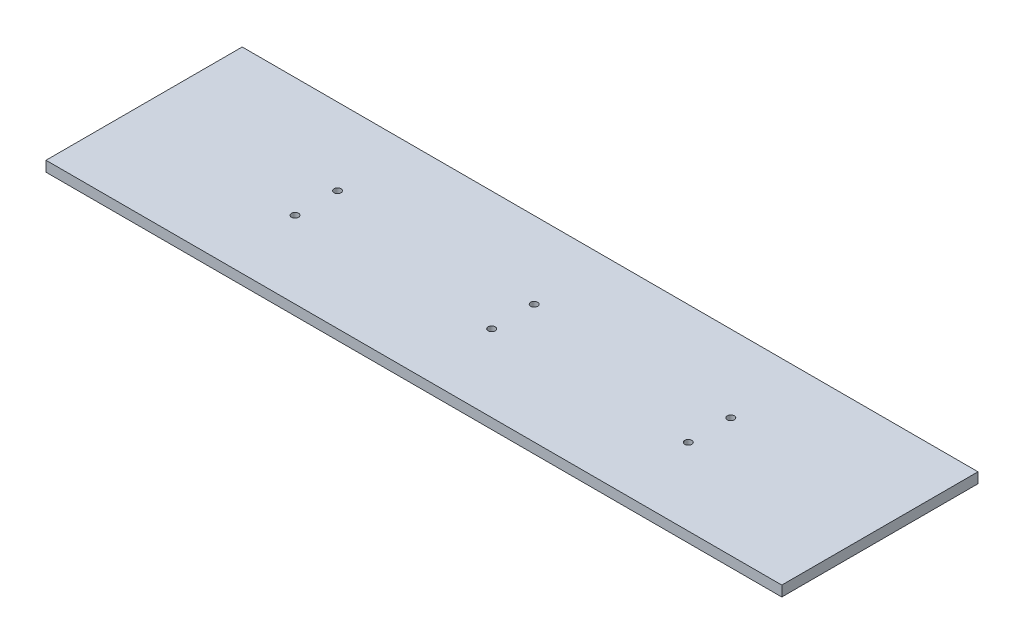
ISO-10303-21;
HEADER;
FILE_DESCRIPTION(('STEP AP214'),'2;1');
FILE_NAME('part.step','',(''),(''),'','','');
FILE_SCHEMA(('AUTOMOTIVE_DESIGN { 1 0 10303 214 1 1 1 1 }'));
ENDSEC;
DATA;
#1=APPLICATION_CONTEXT('core data for automotive mechanical design processes');
#2=APPLICATION_PROTOCOL_DEFINITION('international standard','automotive_design',2000,#1);
#3=PRODUCT_CONTEXT('',#1,'mechanical');
#4=PRODUCT('Part','Part','',(#3));
#5=PRODUCT_RELATED_PRODUCT_CATEGORY('part','',(#4));
#6=PRODUCT_DEFINITION_FORMATION('','',#4);
#7=PRODUCT_DEFINITION_CONTEXT('part definition',#1,'design');
#8=PRODUCT_DEFINITION('design','',#6,#7);
#9=PRODUCT_DEFINITION_SHAPE('','',#8);
#10=(LENGTH_UNIT() NAMED_UNIT(*) SI_UNIT(.MILLI.,.METRE.));
#11=(NAMED_UNIT(*) PLANE_ANGLE_UNIT() SI_UNIT($,.RADIAN.));
#12=(NAMED_UNIT(*) SI_UNIT($,.STERADIAN.) SOLID_ANGLE_UNIT());
#13=UNCERTAINTY_MEASURE_WITH_UNIT(LENGTH_MEASURE(1.E-05),#10,'distance_accuracy_value','');
#14=(GEOMETRIC_REPRESENTATION_CONTEXT(3) GLOBAL_UNCERTAINTY_ASSIGNED_CONTEXT((#13)) GLOBAL_UNIT_ASSIGNED_CONTEXT((#10,
#11,#12)) REPRESENTATION_CONTEXT('',''));
#15=CARTESIAN_POINT('',(0.,0.,0.));
#16=DIRECTION('',(0.,0.,1.));
#17=DIRECTION('',(1.,0.,0.));
#18=AXIS2_PLACEMENT_3D('',#15,#16,#17);
#19=CARTESIAN_POINT('',(0.,6.35,0.));
#20=DIRECTION('',(0.,-1.,0.));
#21=DIRECTION('',(0.,0.,-1.));
#22=AXIS2_PLACEMENT_3D('',#19,#20,#21);
#23=PLANE('',#22);
#24=DIRECTION('',(0.,0.,1.));
#25=VECTOR('',#24,1.);
#26=CARTESIAN_POINT('',(0.,6.35,0.));
#27=LINE('',#26,#25);
#28=CARTESIAN_POINT('',(0.,6.35,-120.));
#29=VERTEX_POINT('',#28);
#30=CARTESIAN_POINT('',(0.,6.35,0.));
#31=VERTEX_POINT('',#30);
#32=EDGE_CURVE('E102',#29,#31,#27,.T.);
#33=ORIENTED_EDGE('',*,*,#32,.T.);
#34=DIRECTION('',(1.,0.,0.));
#35=VECTOR('',#34,1.);
#36=CARTESIAN_POINT('',(0.,6.35,0.));
#37=LINE('',#36,#35);
#38=CARTESIAN_POINT('',(450.,6.35,0.));
#39=VERTEX_POINT('',#38);
#40=EDGE_CURVE('E97',#31,#39,#37,.T.);
#41=ORIENTED_EDGE('',*,*,#40,.T.);
#42=DIRECTION('',(0.,0.,-1.));
#43=VECTOR('',#42,1.);
#44=CARTESIAN_POINT('',(450.,6.35,0.));
#45=LINE('',#44,#43);
#46=CARTESIAN_POINT('',(450.,6.35,-120.));
#47=VERTEX_POINT('',#46);
#48=EDGE_CURVE('E100',#39,#47,#45,.T.);
#49=ORIENTED_EDGE('',*,*,#48,.T.);
#50=DIRECTION('',(-1.,0.,0.));
#51=VECTOR('',#50,1.);
#52=CARTESIAN_POINT('',(0.,6.35,-120.));
#53=LINE('',#52,#51);
#54=EDGE_CURVE('E67',#47,#29,#53,.T.);
#55=ORIENTED_EDGE('',*,*,#54,.T.);
#56=EDGE_LOOP('',(#33,#41,#49,#55));
#57=FACE_BOUND('',#56,.T.);
#58=CARTESIAN_POINT('',(345.81,6.35,-47.));
#59=DIRECTION('',(0.,1.,0.));
#60=DIRECTION('',(0.,0.,1.));
#61=AXIS2_PLACEMENT_3D('',#58,#59,#60);
#62=CIRCLE('',#61,2.16);
#63=CARTESIAN_POINT('',(345.81,6.35,-44.84));
#64=VERTEX_POINT('',#63);
#65=EDGE_CURVE('E122',#64,#64,#62,.T.);
#66=ORIENTED_EDGE('',*,*,#65,.F.);
#67=EDGE_LOOP('',(#66));
#68=FACE_BOUND('',#67,.T.);
#69=CARTESIAN_POINT('',(225.56,6.35,-47.));
#70=DIRECTION('',(0.,1.,0.));
#71=DIRECTION('',(0.,0.,1.));
#72=AXIS2_PLACEMENT_3D('',#69,#70,#71);
#73=CIRCLE('',#72,2.16);
#74=CARTESIAN_POINT('',(225.56,6.35,-44.84));
#75=VERTEX_POINT('',#74);
#76=EDGE_CURVE('E144',#75,#75,#73,.T.);
#77=ORIENTED_EDGE('',*,*,#76,.F.);
#78=EDGE_LOOP('',(#77));
#79=FACE_BOUND('',#78,.T.);
#80=CARTESIAN_POINT('',(105.31,6.35,-47.));
#81=DIRECTION('',(0.,1.,0.));
#82=DIRECTION('',(0.,0.,1.));
#83=AXIS2_PLACEMENT_3D('',#80,#81,#82);
#84=CIRCLE('',#83,2.16);
#85=CARTESIAN_POINT('',(105.31,6.35,-44.84));
#86=VERTEX_POINT('',#85);
#87=EDGE_CURVE('E152',#86,#86,#84,.T.);
#88=ORIENTED_EDGE('',*,*,#87,.F.);
#89=EDGE_LOOP('',(#88));
#90=FACE_BOUND('',#89,.T.);
#91=CARTESIAN_POINT('',(105.31,6.35,-73.));
#92=DIRECTION('',(0.,1.,0.));
#93=DIRECTION('',(0.,0.,-1.));
#94=AXIS2_PLACEMENT_3D('',#91,#92,#93);
#95=CIRCLE('',#94,2.16);
#96=CARTESIAN_POINT('',(105.31,6.35,-75.16));
#97=VERTEX_POINT('',#96);
#98=EDGE_CURVE('E160',#97,#97,#95,.T.);
#99=ORIENTED_EDGE('',*,*,#98,.F.);
#100=EDGE_LOOP('',(#99));
#101=FACE_BOUND('',#100,.T.);
#102=CARTESIAN_POINT('',(225.56,6.35,-73.));
#103=DIRECTION('',(0.,1.,0.));
#104=DIRECTION('',(0.,0.,-1.));
#105=AXIS2_PLACEMENT_3D('',#102,#103,#104);
#106=CIRCLE('',#105,2.16);
#107=CARTESIAN_POINT('',(225.56,6.35,-75.16));
#108=VERTEX_POINT('',#107);
#109=EDGE_CURVE('E168',#108,#108,#106,.T.);
#110=ORIENTED_EDGE('',*,*,#109,.F.);
#111=EDGE_LOOP('',(#110));
#112=FACE_BOUND('',#111,.T.);
#113=CARTESIAN_POINT('',(345.81,6.35,-73.));
#114=DIRECTION('',(0.,1.,0.));
#115=DIRECTION('',(0.,0.,-1.));
#116=AXIS2_PLACEMENT_3D('',#113,#114,#115);
#117=CIRCLE('',#116,2.16);
#118=CARTESIAN_POINT('',(345.81,6.35,-75.16));
#119=VERTEX_POINT('',#118);
#120=EDGE_CURVE('E176',#119,#119,#117,.T.);
#121=ORIENTED_EDGE('',*,*,#120,.F.);
#122=EDGE_LOOP('',(#121));
#123=FACE_BOUND('',#122,.T.);
#124=ADVANCED_FACE('F49',(#57,#68,#79,#90,#101,#112,#123),#23,.F.);
#125=CARTESIAN_POINT('',(0.,0.,0.));
#126=DIRECTION('',(0.,-1.,0.));
#127=DIRECTION('',(0.,0.,-1.));
#128=AXIS2_PLACEMENT_3D('',#125,#126,#127);
#129=PLANE('',#128);
#130=CARTESIAN_POINT('',(225.56,0.,-73.));
#131=DIRECTION('',(0.,1.,0.));
#132=DIRECTION('',(0.,0.,-1.));
#133=AXIS2_PLACEMENT_3D('',#130,#131,#132);
#134=CIRCLE('',#133,2.16);
#135=CARTESIAN_POINT('',(225.56,0.,-75.16));
#136=VERTEX_POINT('',#135);
#137=EDGE_CURVE('E172',#136,#136,#134,.T.);
#138=ORIENTED_EDGE('',*,*,#137,.T.);
#139=EDGE_LOOP('',(#138));
#140=FACE_BOUND('',#139,.T.);
#141=CARTESIAN_POINT('',(105.31,0.,-47.));
#142=DIRECTION('',(0.,1.,0.));
#143=DIRECTION('',(0.,0.,1.));
#144=AXIS2_PLACEMENT_3D('',#141,#142,#143);
#145=CIRCLE('',#144,2.16);
#146=CARTESIAN_POINT('',(105.31,0.,-44.84));
#147=VERTEX_POINT('',#146);
#148=EDGE_CURVE('E156',#147,#147,#145,.T.);
#149=ORIENTED_EDGE('',*,*,#148,.T.);
#150=EDGE_LOOP('',(#149));
#151=FACE_BOUND('',#150,.T.);
#152=CARTESIAN_POINT('',(345.81,0.,-47.));
#153=DIRECTION('',(0.,1.,0.));
#154=DIRECTION('',(0.,0.,1.));
#155=AXIS2_PLACEMENT_3D('',#152,#153,#154);
#156=CIRCLE('',#155,2.16);
#157=CARTESIAN_POINT('',(345.81,0.,-44.84));
#158=VERTEX_POINT('',#157);
#159=EDGE_CURVE('E140',#158,#158,#156,.T.);
#160=ORIENTED_EDGE('',*,*,#159,.T.);
#161=EDGE_LOOP('',(#160));
#162=FACE_BOUND('',#161,.T.);
#163=DIRECTION('',(0.,0.,1.));
#164=VECTOR('',#163,1.);
#165=CARTESIAN_POINT('',(0.,0.,0.));
#166=LINE('',#165,#164);
#167=CARTESIAN_POINT('',(0.,0.,-120.));
#168=VERTEX_POINT('',#167);
#169=CARTESIAN_POINT('',(0.,0.,0.));
#170=VERTEX_POINT('',#169);
#171=EDGE_CURVE('E118',#168,#170,#166,.T.);
#172=ORIENTED_EDGE('',*,*,#171,.F.);
#173=DIRECTION('',(-1.,0.,0.));
#174=VECTOR('',#173,1.);
#175=CARTESIAN_POINT('',(0.,0.,-120.));
#176=LINE('',#175,#174);
#177=CARTESIAN_POINT('',(450.,0.,-120.));
#178=VERTEX_POINT('',#177);
#179=EDGE_CURVE('E90',#178,#168,#176,.T.);
#180=ORIENTED_EDGE('',*,*,#179,.F.);
#181=DIRECTION('',(0.,0.,-1.));
#182=VECTOR('',#181,1.);
#183=CARTESIAN_POINT('',(450.,0.,0.));
#184=LINE('',#183,#182);
#185=CARTESIAN_POINT('',(450.,0.,0.));
#186=VERTEX_POINT('',#185);
#187=EDGE_CURVE('E84',#186,#178,#184,.T.);
#188=ORIENTED_EDGE('',*,*,#187,.F.);
#189=DIRECTION('',(1.,0.,0.));
#190=VECTOR('',#189,1.);
#191=CARTESIAN_POINT('',(0.,0.,0.));
#192=LINE('',#191,#190);
#193=EDGE_CURVE('E107',#170,#186,#192,.T.);
#194=ORIENTED_EDGE('',*,*,#193,.F.);
#195=EDGE_LOOP('',(#172,#180,#188,#194));
#196=FACE_BOUND('',#195,.T.);
#197=CARTESIAN_POINT('',(225.56,0.,-47.));
#198=DIRECTION('',(0.,1.,0.));
#199=DIRECTION('',(0.,0.,1.));
#200=AXIS2_PLACEMENT_3D('',#197,#198,#199);
#201=CIRCLE('',#200,2.16);
#202=CARTESIAN_POINT('',(225.56,0.,-44.84));
#203=VERTEX_POINT('',#202);
#204=EDGE_CURVE('E148',#203,#203,#201,.T.);
#205=ORIENTED_EDGE('',*,*,#204,.T.);
#206=EDGE_LOOP('',(#205));
#207=FACE_BOUND('',#206,.T.);
#208=CARTESIAN_POINT('',(105.31,0.,-73.));
#209=DIRECTION('',(0.,1.,0.));
#210=DIRECTION('',(0.,0.,-1.));
#211=AXIS2_PLACEMENT_3D('',#208,#209,#210);
#212=CIRCLE('',#211,2.16);
#213=CARTESIAN_POINT('',(105.31,0.,-75.16));
#214=VERTEX_POINT('',#213);
#215=EDGE_CURVE('E164',#214,#214,#212,.T.);
#216=ORIENTED_EDGE('',*,*,#215,.T.);
#217=EDGE_LOOP('',(#216));
#218=FACE_BOUND('',#217,.T.);
#219=CARTESIAN_POINT('',(345.81,0.,-73.));
#220=DIRECTION('',(0.,1.,0.));
#221=DIRECTION('',(0.,0.,-1.));
#222=AXIS2_PLACEMENT_3D('',#219,#220,#221);
#223=CIRCLE('',#222,2.16);
#224=CARTESIAN_POINT('',(345.81,0.,-75.16));
#225=VERTEX_POINT('',#224);
#226=EDGE_CURVE('E180',#225,#225,#223,.T.);
#227=ORIENTED_EDGE('',*,*,#226,.T.);
#228=EDGE_LOOP('',(#227));
#229=FACE_BOUND('',#228,.T.);
#230=ADVANCED_FACE('F135',(#140,#151,#162,#196,#207,#218,#229),#129,.T.);
#231=CARTESIAN_POINT('',(0.,6.35,0.));
#232=DIRECTION('',(1.,0.,0.));
#233=DIRECTION('',(0.,0.,-1.));
#234=AXIS2_PLACEMENT_3D('',#231,#232,#233);
#235=PLANE('',#234);
#236=ORIENTED_EDGE('',*,*,#171,.T.);
#237=DIRECTION('',(0.,-1.,0.));
#238=VECTOR('',#237,1.);
#239=CARTESIAN_POINT('',(0.,6.35,0.));
#240=LINE('',#239,#238);
#241=EDGE_CURVE('E11',#31,#170,#240,.T.);
#242=ORIENTED_EDGE('',*,*,#241,.F.);
#243=ORIENTED_EDGE('',*,*,#32,.F.);
#244=DIRECTION('',(0.,-1.,0.));
#245=VECTOR('',#244,1.);
#246=CARTESIAN_POINT('',(0.,6.35,-120.));
#247=LINE('',#246,#245);
#248=EDGE_CURVE('E114',#29,#168,#247,.T.);
#249=ORIENTED_EDGE('',*,*,#248,.T.);
#250=EDGE_LOOP('',(#236,#242,#243,#249));
#251=FACE_BOUND('',#250,.T.);
#252=ADVANCED_FACE('F51',(#251),#235,.F.);
#253=CARTESIAN_POINT('',(0.,6.35,0.));
#254=DIRECTION('',(0.,0.,-1.));
#255=DIRECTION('',(-1.,0.,0.));
#256=AXIS2_PLACEMENT_3D('',#253,#254,#255);
#257=PLANE('',#256);
#258=ORIENTED_EDGE('',*,*,#193,.T.);
#259=DIRECTION('',(0.,-1.,0.));
#260=VECTOR('',#259,1.);
#261=CARTESIAN_POINT('',(450.,6.35,0.));
#262=LINE('',#261,#260);
#263=EDGE_CURVE('E59',#39,#186,#262,.T.);
#264=ORIENTED_EDGE('',*,*,#263,.F.);
#265=ORIENTED_EDGE('',*,*,#40,.F.);
#266=ORIENTED_EDGE('',*,*,#241,.T.);
#267=EDGE_LOOP('',(#258,#264,#265,#266));
#268=FACE_BOUND('',#267,.T.);
#269=ADVANCED_FACE('F106',(#268),#257,.F.);
#270=CARTESIAN_POINT('',(450.,6.35,0.));
#271=DIRECTION('',(-1.,0.,0.));
#272=DIRECTION('',(0.,0.,1.));
#273=AXIS2_PLACEMENT_3D('',#270,#271,#272);
#274=PLANE('',#273);
#275=ORIENTED_EDGE('',*,*,#187,.T.);
#276=DIRECTION('',(0.,-1.,0.));
#277=VECTOR('',#276,1.);
#278=CARTESIAN_POINT('',(450.,6.35,-120.));
#279=LINE('',#278,#277);
#280=EDGE_CURVE('E109',#47,#178,#279,.T.);
#281=ORIENTED_EDGE('',*,*,#280,.F.);
#282=ORIENTED_EDGE('',*,*,#48,.F.);
#283=ORIENTED_EDGE('',*,*,#263,.T.);
#284=EDGE_LOOP('',(#275,#281,#282,#283));
#285=FACE_BOUND('',#284,.T.);
#286=ADVANCED_FACE('F110',(#285),#274,.F.);
#287=CARTESIAN_POINT('',(0.,6.35,-120.));
#288=DIRECTION('',(0.,0.,1.));
#289=DIRECTION('',(1.,0.,0.));
#290=AXIS2_PLACEMENT_3D('',#287,#288,#289);
#291=PLANE('',#290);
#292=ORIENTED_EDGE('',*,*,#179,.T.);
#293=ORIENTED_EDGE('',*,*,#248,.F.);
#294=ORIENTED_EDGE('',*,*,#54,.F.);
#295=ORIENTED_EDGE('',*,*,#280,.T.);
#296=EDGE_LOOP('',(#292,#293,#294,#295));
#297=FACE_BOUND('',#296,.T.);
#298=ADVANCED_FACE('F132',(#297),#291,.F.);
#299=CARTESIAN_POINT('',(345.81,6.35,-47.));
#300=DIRECTION('',(0.,-1.,0.));
#301=DIRECTION('',(0.,0.,-1.));
#302=AXIS2_PLACEMENT_3D('',#299,#300,#301);
#303=CYLINDRICAL_SURFACE('',#302,2.16);
#304=ORIENTED_EDGE('',*,*,#65,.T.);
#305=EDGE_LOOP('',(#304));
#306=FACE_BOUND('',#305,.T.);
#307=ORIENTED_EDGE('',*,*,#159,.F.);
#308=EDGE_LOOP('',(#307));
#309=FACE_BOUND('',#308,.T.);
#310=ADVANCED_FACE('F199',(#306,#309),#303,.F.);
#311=CARTESIAN_POINT('',(225.56,6.35,-47.));
#312=DIRECTION('',(0.,-1.,0.));
#313=DIRECTION('',(0.,0.,-1.));
#314=AXIS2_PLACEMENT_3D('',#311,#312,#313);
#315=CYLINDRICAL_SURFACE('',#314,2.16);
#316=ORIENTED_EDGE('',*,*,#76,.T.);
#317=EDGE_LOOP('',(#316));
#318=FACE_BOUND('',#317,.T.);
#319=ORIENTED_EDGE('',*,*,#204,.F.);
#320=EDGE_LOOP('',(#319));
#321=FACE_BOUND('',#320,.T.);
#322=ADVANCED_FACE('F267',(#318,#321),#315,.F.);
#323=CARTESIAN_POINT('',(105.31,6.35,-47.));
#324=DIRECTION('',(0.,-1.,0.));
#325=DIRECTION('',(0.,0.,-1.));
#326=AXIS2_PLACEMENT_3D('',#323,#324,#325);
#327=CYLINDRICAL_SURFACE('',#326,2.16);
#328=ORIENTED_EDGE('',*,*,#87,.T.);
#329=EDGE_LOOP('',(#328));
#330=FACE_BOUND('',#329,.T.);
#331=ORIENTED_EDGE('',*,*,#148,.F.);
#332=EDGE_LOOP('',(#331));
#333=FACE_BOUND('',#332,.T.);
#334=ADVANCED_FACE('F278',(#330,#333),#327,.F.);
#335=CARTESIAN_POINT('',(105.31,6.35,-73.));
#336=DIRECTION('',(0.,-1.,0.));
#337=DIRECTION('',(0.,0.,-1.));
#338=AXIS2_PLACEMENT_3D('',#335,#336,#337);
#339=CYLINDRICAL_SURFACE('',#338,2.16);
#340=ORIENTED_EDGE('',*,*,#98,.T.);
#341=EDGE_LOOP('',(#340));
#342=FACE_BOUND('',#341,.T.);
#343=ORIENTED_EDGE('',*,*,#215,.F.);
#344=EDGE_LOOP('',(#343));
#345=FACE_BOUND('',#344,.T.);
#346=ADVANCED_FACE('F289',(#342,#345),#339,.F.);
#347=CARTESIAN_POINT('',(225.56,6.35,-73.));
#348=DIRECTION('',(0.,-1.,0.));
#349=DIRECTION('',(0.,0.,-1.));
#350=AXIS2_PLACEMENT_3D('',#347,#348,#349);
#351=CYLINDRICAL_SURFACE('',#350,2.16);
#352=ORIENTED_EDGE('',*,*,#109,.T.);
#353=EDGE_LOOP('',(#352));
#354=FACE_BOUND('',#353,.T.);
#355=ORIENTED_EDGE('',*,*,#137,.F.);
#356=EDGE_LOOP('',(#355));
#357=FACE_BOUND('',#356,.T.);
#358=ADVANCED_FACE('F301',(#354,#357),#351,.F.);
#359=CARTESIAN_POINT('',(345.81,6.35,-73.));
#360=DIRECTION('',(0.,-1.,0.));
#361=DIRECTION('',(0.,0.,-1.));
#362=AXIS2_PLACEMENT_3D('',#359,#360,#361);
#363=CYLINDRICAL_SURFACE('',#362,2.16);
#364=ORIENTED_EDGE('',*,*,#120,.T.);
#365=EDGE_LOOP('',(#364));
#366=FACE_BOUND('',#365,.T.);
#367=ORIENTED_EDGE('',*,*,#226,.F.);
#368=EDGE_LOOP('',(#367));
#369=FACE_BOUND('',#368,.T.);
#370=ADVANCED_FACE('F188',(#366,#369),#363,.F.);
#371=CLOSED_SHELL('',(#124,#230,#252,#269,#286,#298,#310,#322,#334,#346,#358,#370));
#372=MANIFOLD_SOLID_BREP('B2',#371);
#373=ADVANCED_BREP_SHAPE_REPRESENTATION('',(#18,#372),#14);
#374=SHAPE_DEFINITION_REPRESENTATION(#9,#373);
ENDSEC;
END-ISO-10303-21;
